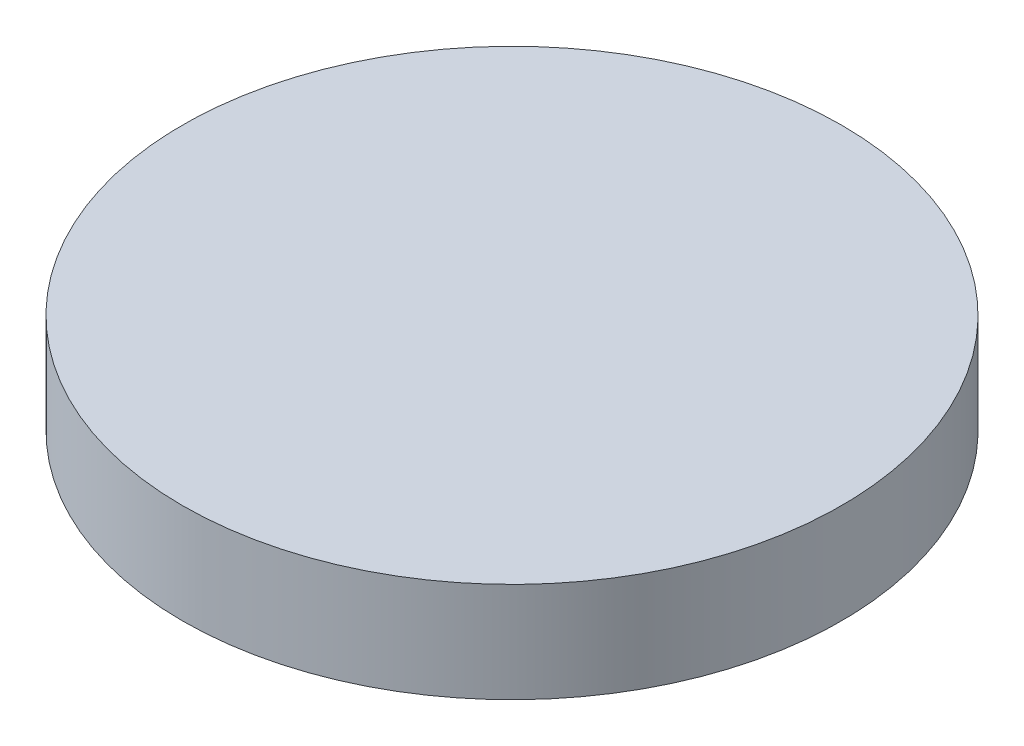
ISO-10303-21;
HEADER;
FILE_DESCRIPTION(('STEP AP214'),'2;1');
FILE_NAME('part.step','',(''),(''),'','','');
FILE_SCHEMA(('AUTOMOTIVE_DESIGN { 1 0 10303 214 1 1 1 1 }'));
ENDSEC;
DATA;
#1=APPLICATION_CONTEXT('core data for automotive mechanical design processes');
#2=APPLICATION_PROTOCOL_DEFINITION('international standard','automotive_design',2000,#1);
#3=PRODUCT_CONTEXT('',#1,'mechanical');
#4=PRODUCT('Part','Part','',(#3));
#5=PRODUCT_RELATED_PRODUCT_CATEGORY('part','',(#4));
#6=PRODUCT_DEFINITION_FORMATION('','',#4);
#7=PRODUCT_DEFINITION_CONTEXT('part definition',#1,'design');
#8=PRODUCT_DEFINITION('design','',#6,#7);
#9=PRODUCT_DEFINITION_SHAPE('','',#8);
#10=(LENGTH_UNIT() NAMED_UNIT(*) SI_UNIT(.MILLI.,.METRE.));
#11=(NAMED_UNIT(*) PLANE_ANGLE_UNIT() SI_UNIT($,.RADIAN.));
#12=(NAMED_UNIT(*) SI_UNIT($,.STERADIAN.) SOLID_ANGLE_UNIT());
#13=UNCERTAINTY_MEASURE_WITH_UNIT(LENGTH_MEASURE(1.E-05),#10,'distance_accuracy_value','');
#14=(GEOMETRIC_REPRESENTATION_CONTEXT(3) GLOBAL_UNCERTAINTY_ASSIGNED_CONTEXT((#13)) GLOBAL_UNIT_ASSIGNED_CONTEXT((#10,
#11,#12)) REPRESENTATION_CONTEXT('',''));
#15=CARTESIAN_POINT('',(0.,0.,0.));
#16=DIRECTION('',(0.,0.,1.));
#17=DIRECTION('',(1.,0.,0.));
#18=AXIS2_PLACEMENT_3D('',#15,#16,#17);
#19=CARTESIAN_POINT('',(0.,0.,0.));
#20=DIRECTION('',(0.,1.,0.));
#21=DIRECTION('',(0.,0.,1.));
#22=AXIS2_PLACEMENT_3D('',#19,#20,#21);
#23=PLANE('',#22);
#24=CARTESIAN_POINT('',(0.,0.,0.));
#25=DIRECTION('',(0.,-1.,0.));
#26=DIRECTION('',(0.,0.,-1.));
#27=AXIS2_PLACEMENT_3D('',#24,#25,#26);
#28=CIRCLE('',#27,1.65);
#29=CARTESIAN_POINT('',(0.,0.,-1.65));
#30=VERTEX_POINT('',#29);
#31=EDGE_CURVE('E17',#30,#30,#28,.F.);
#32=ORIENTED_EDGE('',*,*,#31,.F.);
#33=EDGE_LOOP('',(#32));
#34=FACE_BOUND('',#33,.T.);
#35=ADVANCED_FACE('F14',(#34),#23,.F.);
#36=CARTESIAN_POINT('',(0.,0.5,0.));
#37=DIRECTION('',(0.,-1.,0.));
#38=DIRECTION('',(0.,0.,-1.));
#39=AXIS2_PLACEMENT_3D('',#36,#37,#38);
#40=CYLINDRICAL_SURFACE('',#39,1.65);
#41=ORIENTED_EDGE('',*,*,#31,.T.);
#42=EDGE_LOOP('',(#41));
#43=FACE_BOUND('',#42,.T.);
#44=CARTESIAN_POINT('',(0.,0.5,0.));
#45=DIRECTION('',(0.,-1.,0.));
#46=DIRECTION('',(0.,0.,-1.));
#47=AXIS2_PLACEMENT_3D('',#44,#45,#46);
#48=CIRCLE('',#47,1.65);
#49=CARTESIAN_POINT('',(0.,0.5,-1.65));
#50=VERTEX_POINT('',#49);
#51=EDGE_CURVE('E9',#50,#50,#48,.F.);
#52=ORIENTED_EDGE('',*,*,#51,.F.);
#53=EDGE_LOOP('',(#52));
#54=FACE_BOUND('',#53,.T.);
#55=ADVANCED_FACE('F26',(#43,#54),#40,.T.);
#56=CARTESIAN_POINT('',(0.,0.5,0.));
#57=DIRECTION('',(0.,1.,0.));
#58=DIRECTION('',(0.,0.,1.));
#59=AXIS2_PLACEMENT_3D('',#56,#57,#58);
#60=PLANE('',#59);
#61=ORIENTED_EDGE('',*,*,#51,.T.);
#62=EDGE_LOOP('',(#61));
#63=FACE_BOUND('',#62,.T.);
#64=ADVANCED_FACE('F34',(#63),#60,.T.);
#65=CLOSED_SHELL('',(#35,#55,#64));
#66=MANIFOLD_SOLID_BREP('B1',#65);
#67=ADVANCED_BREP_SHAPE_REPRESENTATION('',(#18,#66),#14);
#68=SHAPE_DEFINITION_REPRESENTATION(#9,#67);
ENDSEC;
END-ISO-10303-21;
